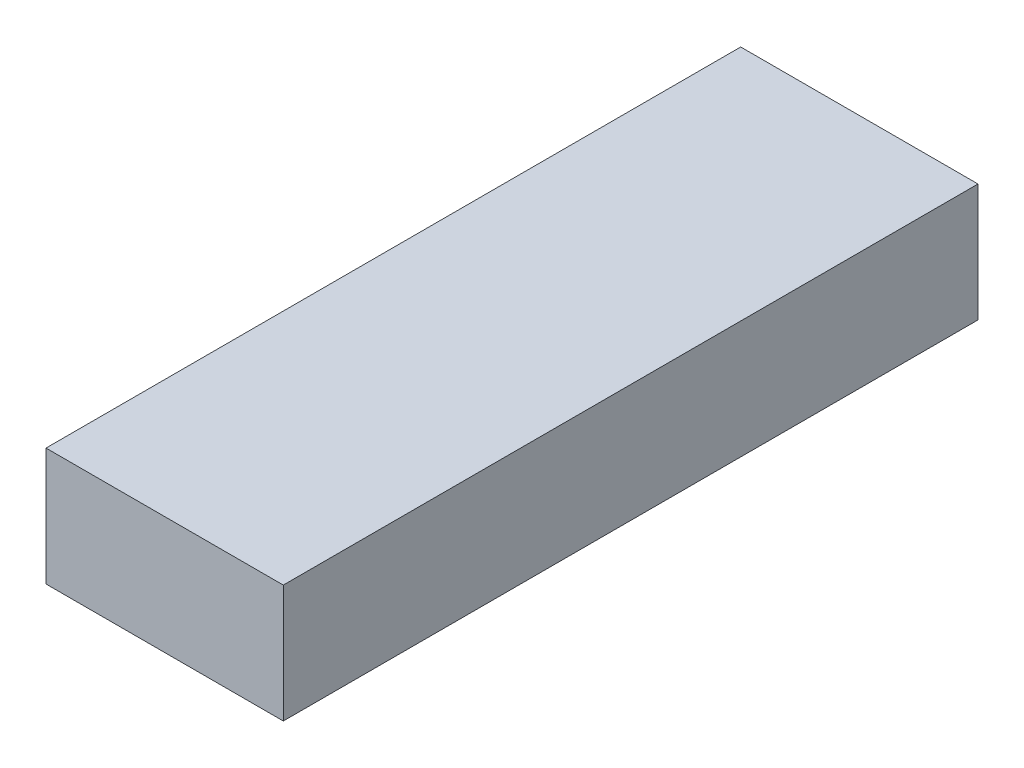
ISO-10303-21;
HEADER;
FILE_DESCRIPTION(('STEP AP214'),'2;1');
FILE_NAME('part.step','',(''),(''),'','','');
FILE_SCHEMA(('AUTOMOTIVE_DESIGN { 1 0 10303 214 1 1 1 1 }'));
ENDSEC;
DATA;
#1=APPLICATION_CONTEXT('core data for automotive mechanical design processes');
#2=APPLICATION_PROTOCOL_DEFINITION('international standard','automotive_design',2000,#1);
#3=PRODUCT_CONTEXT('',#1,'mechanical');
#4=PRODUCT('Part','Part','',(#3));
#5=PRODUCT_RELATED_PRODUCT_CATEGORY('part','',(#4));
#6=PRODUCT_DEFINITION_FORMATION('','',#4);
#7=PRODUCT_DEFINITION_CONTEXT('part definition',#1,'design');
#8=PRODUCT_DEFINITION('design','',#6,#7);
#9=PRODUCT_DEFINITION_SHAPE('','',#8);
#10=(LENGTH_UNIT() NAMED_UNIT(*) SI_UNIT(.MILLI.,.METRE.));
#11=(NAMED_UNIT(*) PLANE_ANGLE_UNIT() SI_UNIT($,.RADIAN.));
#12=(NAMED_UNIT(*) SI_UNIT($,.STERADIAN.) SOLID_ANGLE_UNIT());
#13=UNCERTAINTY_MEASURE_WITH_UNIT(LENGTH_MEASURE(1.E-05),#10,'distance_accuracy_value','');
#14=(GEOMETRIC_REPRESENTATION_CONTEXT(3) GLOBAL_UNCERTAINTY_ASSIGNED_CONTEXT((#13)) GLOBAL_UNIT_ASSIGNED_CONTEXT((#10,
#11,#12)) REPRESENTATION_CONTEXT('',''));
#15=CARTESIAN_POINT('',(0.,0.,0.));
#16=DIRECTION('',(0.,0.,1.));
#17=DIRECTION('',(1.,0.,0.));
#18=AXIS2_PLACEMENT_3D('',#15,#16,#17);
#19=CARTESIAN_POINT('',(4.55229940712927,-40.3391681794489,-8.91942102613883));
#20=DIRECTION('',(-1.,0.,0.));
#21=DIRECTION('',(0.,0.,1.));
#22=AXIS2_PLACEMENT_3D('',#19,#20,#21);
#23=PLANE('',#22);
#24=CARTESIAN_POINT('',(4.55229940712927,-40.2895505391591,-8.91942102613884));
#25=CARTESIAN_POINT('',(4.55229940712927,-40.2895505391591,-9.21216510384864));
#26=(BOUNDED_CURVE() B_SPLINE_CURVE(1,(#24,#25),.UNSPECIFIED.,.F.,
.F.) B_SPLINE_CURVE_WITH_KNOTS((2,2),(6.,7.),
.UNSPECIFIED.) CURVE() GEOMETRIC_REPRESENTATION_ITEM() RATIONAL_B_SPLINE_CURVE((1.,1.)) REPRESENTATION_ITEM(''));
#27=CARTESIAN_POINT('',(4.55229940712927,-40.2895505391591,-8.91942102613884));
#28=VERTEX_POINT('',#27);
#29=CARTESIAN_POINT('',(4.55229940712927,-40.2895505391591,-9.21216510384864));
#30=VERTEX_POINT('',#29);
#31=EDGE_CURVE('E86',#28,#30,#26,.T.);
#32=ORIENTED_EDGE('',*,*,#31,.T.);
#33=CARTESIAN_POINT('',(4.55229940712927,-40.2895505391591,-9.21216510384864));
#34=CARTESIAN_POINT('',(4.55229940712928,-40.3391681794489,-9.21216510384864));
#35=(BOUNDED_CURVE() B_SPLINE_CURVE(1,(#33,#34),.UNSPECIFIED.,.F.,
.F.) B_SPLINE_CURVE_WITH_KNOTS((2,2),(7.,8.),
.UNSPECIFIED.) CURVE() GEOMETRIC_REPRESENTATION_ITEM() RATIONAL_B_SPLINE_CURVE((1.,1.)) REPRESENTATION_ITEM(''));
#36=CARTESIAN_POINT('',(4.55229940712928,-40.3391681794489,-9.21216510384864));
#37=VERTEX_POINT('',#36);
#38=EDGE_CURVE('E84',#30,#37,#35,.T.);
#39=ORIENTED_EDGE('',*,*,#38,.T.);
#40=CARTESIAN_POINT('',(4.55229940712928,-40.3391681794489,-9.21216510384864));
#41=CARTESIAN_POINT('',(4.55229940712927,-40.3391681794489,-8.91942102613884));
#42=(BOUNDED_CURVE() B_SPLINE_CURVE(1,(#40,#41),.UNSPECIFIED.,.F.,
.F.) B_SPLINE_CURVE_WITH_KNOTS((2,2),(8.,9.),
.UNSPECIFIED.) CURVE() GEOMETRIC_REPRESENTATION_ITEM() RATIONAL_B_SPLINE_CURVE((1.,1.)) REPRESENTATION_ITEM(''));
#43=CARTESIAN_POINT('',(4.55229940712927,-40.3391681794489,-8.91942102613884));
#44=VERTEX_POINT('',#43);
#45=EDGE_CURVE('E73',#37,#44,#42,.T.);
#46=ORIENTED_EDGE('',*,*,#45,.T.);
#47=CARTESIAN_POINT('',(4.55229940712927,-40.3391681794489,-8.91942102613884));
#48=CARTESIAN_POINT('',(4.55229940712927,-40.2895505391591,-8.91942102613884));
#49=(BOUNDED_CURVE() B_SPLINE_CURVE(1,(#47,#48),.UNSPECIFIED.,.F.,
.F.) B_SPLINE_CURVE_WITH_KNOTS((2,2),(9.,10.),
.UNSPECIFIED.) CURVE() GEOMETRIC_REPRESENTATION_ITEM() RATIONAL_B_SPLINE_CURVE((1.,1.)) REPRESENTATION_ITEM(''));
#50=EDGE_CURVE('E11',#44,#28,#49,.T.);
#51=ORIENTED_EDGE('',*,*,#50,.T.);
#52=EDGE_LOOP('',(#32,#39,#46,#51));
#53=FACE_BOUND('',#52,.T.);
#54=ADVANCED_FACE('F16',(#53),#23,.T.);
#55=CARTESIAN_POINT('',(4.65229940712928,-40.3391681794489,-8.91942102613884));
#56=DIRECTION('',(1.,0.,0.));
#57=DIRECTION('',(0.,1.,0.));
#58=AXIS2_PLACEMENT_3D('',#55,#56,#57);
#59=PLANE('',#58);
#60=CARTESIAN_POINT('',(4.65229940712928,-40.3391681794489,-8.91942102613884));
#61=CARTESIAN_POINT('',(4.65229940712927,-40.2895505391591,-8.91942102613884));
#62=(BOUNDED_CURVE() B_SPLINE_CURVE(1,(#60,#61),.UNSPECIFIED.,.F.,
.F.) B_SPLINE_CURVE_WITH_KNOTS((2,2),(9.,10.),
.UNSPECIFIED.) CURVE() GEOMETRIC_REPRESENTATION_ITEM() RATIONAL_B_SPLINE_CURVE((1.,1.)) REPRESENTATION_ITEM(''));
#63=CARTESIAN_POINT('',(4.65229940712928,-40.3391681794489,-8.91942102613884));
#64=VERTEX_POINT('',#63);
#65=CARTESIAN_POINT('',(4.65229940712927,-40.2895505391591,-8.91942102613884));
#66=VERTEX_POINT('',#65);
#67=EDGE_CURVE('E28',#64,#66,#62,.T.);
#68=ORIENTED_EDGE('',*,*,#67,.F.);
#69=CARTESIAN_POINT('',(4.65229940712928,-40.3391681794489,-9.21216510384864));
#70=CARTESIAN_POINT('',(4.65229940712928,-40.3391681794489,-8.91942102613884));
#71=(BOUNDED_CURVE() B_SPLINE_CURVE(1,(#69,#70),.UNSPECIFIED.,.F.,
.F.) B_SPLINE_CURVE_WITH_KNOTS((2,2),(8.,9.),
.UNSPECIFIED.) CURVE() GEOMETRIC_REPRESENTATION_ITEM() RATIONAL_B_SPLINE_CURVE((1.,1.)) REPRESENTATION_ITEM(''));
#72=CARTESIAN_POINT('',(4.65229940712928,-40.3391681794489,-9.21216510384864));
#73=VERTEX_POINT('',#72);
#74=EDGE_CURVE('E66',#73,#64,#71,.T.);
#75=ORIENTED_EDGE('',*,*,#74,.F.);
#76=CARTESIAN_POINT('',(4.65229940712927,-40.2895505391591,-9.21216510384864));
#77=CARTESIAN_POINT('',(4.65229940712928,-40.3391681794489,-9.21216510384864));
#78=(BOUNDED_CURVE() B_SPLINE_CURVE(1,(#76,#77),.UNSPECIFIED.,.F.,
.F.) B_SPLINE_CURVE_WITH_KNOTS((2,2),(7.,8.),
.UNSPECIFIED.) CURVE() GEOMETRIC_REPRESENTATION_ITEM() RATIONAL_B_SPLINE_CURVE((1.,1.)) REPRESENTATION_ITEM(''));
#79=CARTESIAN_POINT('',(4.65229940712927,-40.2895505391591,-9.21216510384864));
#80=VERTEX_POINT('',#79);
#81=EDGE_CURVE('E19',#80,#73,#78,.T.);
#82=ORIENTED_EDGE('',*,*,#81,.F.);
#83=CARTESIAN_POINT('',(4.65229940712927,-40.2895505391591,-8.91942102613884));
#84=CARTESIAN_POINT('',(4.65229940712927,-40.2895505391591,-9.21216510384864));
#85=(BOUNDED_CURVE() B_SPLINE_CURVE(1,(#83,#84),.UNSPECIFIED.,.F.,
.F.) B_SPLINE_CURVE_WITH_KNOTS((2,2),(6.,7.),
.UNSPECIFIED.) CURVE() GEOMETRIC_REPRESENTATION_ITEM() RATIONAL_B_SPLINE_CURVE((1.,1.)) REPRESENTATION_ITEM(''));
#86=EDGE_CURVE('E120',#66,#80,#85,.T.);
#87=ORIENTED_EDGE('',*,*,#86,.F.);
#88=EDGE_LOOP('',(#68,#75,#82,#87));
#89=FACE_BOUND('',#88,.T.);
#90=ADVANCED_FACE('F169',(#89),#59,.T.);
#91=CARTESIAN_POINT('',(4.65229940712928,-40.3391681794489,-8.91942102613884));
#92=DIRECTION('',(0.,0.,1.));
#93=DIRECTION('',(1.,0.,0.));
#94=AXIS2_PLACEMENT_3D('',#91,#92,#93);
#95=PLANE('',#94);
#96=ORIENTED_EDGE('',*,*,#67,.T.);
#97=CARTESIAN_POINT('',(4.65229940712927,-40.2895505391591,-8.91942102613884));
#98=CARTESIAN_POINT('',(4.55229940712927,-40.2895505391591,-8.91942102613884));
#99=(BOUNDED_CURVE() B_SPLINE_CURVE(1,(#97,#98),.UNSPECIFIED.,.F.,
.F.) B_SPLINE_CURVE_WITH_KNOTS((2,2),(0.,0.1),
.UNSPECIFIED.) CURVE() GEOMETRIC_REPRESENTATION_ITEM() RATIONAL_B_SPLINE_CURVE((1.,1.)) REPRESENTATION_ITEM(''));
#100=EDGE_CURVE('E98',#66,#28,#99,.T.);
#101=ORIENTED_EDGE('',*,*,#100,.T.);
#102=ORIENTED_EDGE('',*,*,#50,.F.);
#103=CARTESIAN_POINT('',(4.65229940712928,-40.3391681794489,-8.91942102613884));
#104=CARTESIAN_POINT('',(4.55229940712927,-40.3391681794489,-8.91942102613884));
#105=(BOUNDED_CURVE() B_SPLINE_CURVE(1,(#103,#104),.UNSPECIFIED.,.F.,
.F.) B_SPLINE_CURVE_WITH_KNOTS((2,2),(0.,0.1),
.UNSPECIFIED.) CURVE() GEOMETRIC_REPRESENTATION_ITEM() RATIONAL_B_SPLINE_CURVE((1.,1.)) REPRESENTATION_ITEM(''));
#106=EDGE_CURVE('E79',#64,#44,#105,.T.);
#107=ORIENTED_EDGE('',*,*,#106,.F.);
#108=EDGE_LOOP('',(#96,#101,#102,#107));
#109=FACE_BOUND('',#108,.T.);
#110=ADVANCED_FACE('F170',(#109),#95,.T.);
#111=CARTESIAN_POINT('',(4.65229940712928,-40.3391681794489,-9.21216510384864));
#112=DIRECTION('',(0.,-1.,0.));
#113=DIRECTION('',(0.,0.,-1.));
#114=AXIS2_PLACEMENT_3D('',#111,#112,#113);
#115=PLANE('',#114);
#116=ORIENTED_EDGE('',*,*,#74,.T.);
#117=ORIENTED_EDGE('',*,*,#106,.T.);
#118=ORIENTED_EDGE('',*,*,#45,.F.);
#119=CARTESIAN_POINT('',(4.65229940712928,-40.3391681794489,-9.21216510384864));
#120=CARTESIAN_POINT('',(4.55229940712928,-40.3391681794489,-9.21216510384864));
#121=(BOUNDED_CURVE() B_SPLINE_CURVE(1,(#119,#120),.UNSPECIFIED.,.F.,
.F.) B_SPLINE_CURVE_WITH_KNOTS((2,2),(0.,0.1),
.UNSPECIFIED.) CURVE() GEOMETRIC_REPRESENTATION_ITEM() RATIONAL_B_SPLINE_CURVE((1.,1.)) REPRESENTATION_ITEM(''));
#122=EDGE_CURVE('E77',#73,#37,#121,.T.);
#123=ORIENTED_EDGE('',*,*,#122,.F.);
#124=EDGE_LOOP('',(#116,#117,#118,#123));
#125=FACE_BOUND('',#124,.T.);
#126=ADVANCED_FACE('F75',(#125),#115,.T.);
#127=CARTESIAN_POINT('',(4.65229940712927,-40.2895505391591,-9.21216510384864));
#128=DIRECTION('',(0.,0.,-1.));
#129=DIRECTION('',(0.,-1.,0.));
#130=AXIS2_PLACEMENT_3D('',#127,#128,#129);
#131=PLANE('',#130);
#132=ORIENTED_EDGE('',*,*,#81,.T.);
#133=ORIENTED_EDGE('',*,*,#122,.T.);
#134=ORIENTED_EDGE('',*,*,#38,.F.);
#135=CARTESIAN_POINT('',(4.65229940712927,-40.2895505391591,-9.21216510384864));
#136=CARTESIAN_POINT('',(4.55229940712927,-40.2895505391591,-9.21216510384864));
#137=(BOUNDED_CURVE() B_SPLINE_CURVE(1,(#135,#136),.UNSPECIFIED.,.F.,
.F.) B_SPLINE_CURVE_WITH_KNOTS((2,2),(0.,0.1),
.UNSPECIFIED.) CURVE() GEOMETRIC_REPRESENTATION_ITEM() RATIONAL_B_SPLINE_CURVE((1.,1.)) REPRESENTATION_ITEM(''));
#138=EDGE_CURVE('E115',#80,#30,#137,.T.);
#139=ORIENTED_EDGE('',*,*,#138,.F.);
#140=EDGE_LOOP('',(#132,#133,#134,#139));
#141=FACE_BOUND('',#140,.T.);
#142=ADVANCED_FACE('F92',(#141),#131,.T.);
#143=CARTESIAN_POINT('',(4.65229940712927,-40.2895505391591,-8.91942102613884));
#144=DIRECTION('',(0.,1.,0.));
#145=DIRECTION('',(1.,0.,0.));
#146=AXIS2_PLACEMENT_3D('',#143,#144,#145);
#147=PLANE('',#146);
#148=ORIENTED_EDGE('',*,*,#86,.T.);
#149=ORIENTED_EDGE('',*,*,#138,.T.);
#150=ORIENTED_EDGE('',*,*,#31,.F.);
#151=ORIENTED_EDGE('',*,*,#100,.F.);
#152=EDGE_LOOP('',(#148,#149,#150,#151));
#153=FACE_BOUND('',#152,.T.);
#154=ADVANCED_FACE('F168',(#153),#147,.T.);
#155=CLOSED_SHELL('',(#54,#90,#110,#126,#142,#154));
#156=MANIFOLD_SOLID_BREP('B1',#155);
#157=ADVANCED_BREP_SHAPE_REPRESENTATION('',(#18,#156),#14);
#158=SHAPE_DEFINITION_REPRESENTATION(#9,#157);
ENDSEC;
END-ISO-10303-21;
